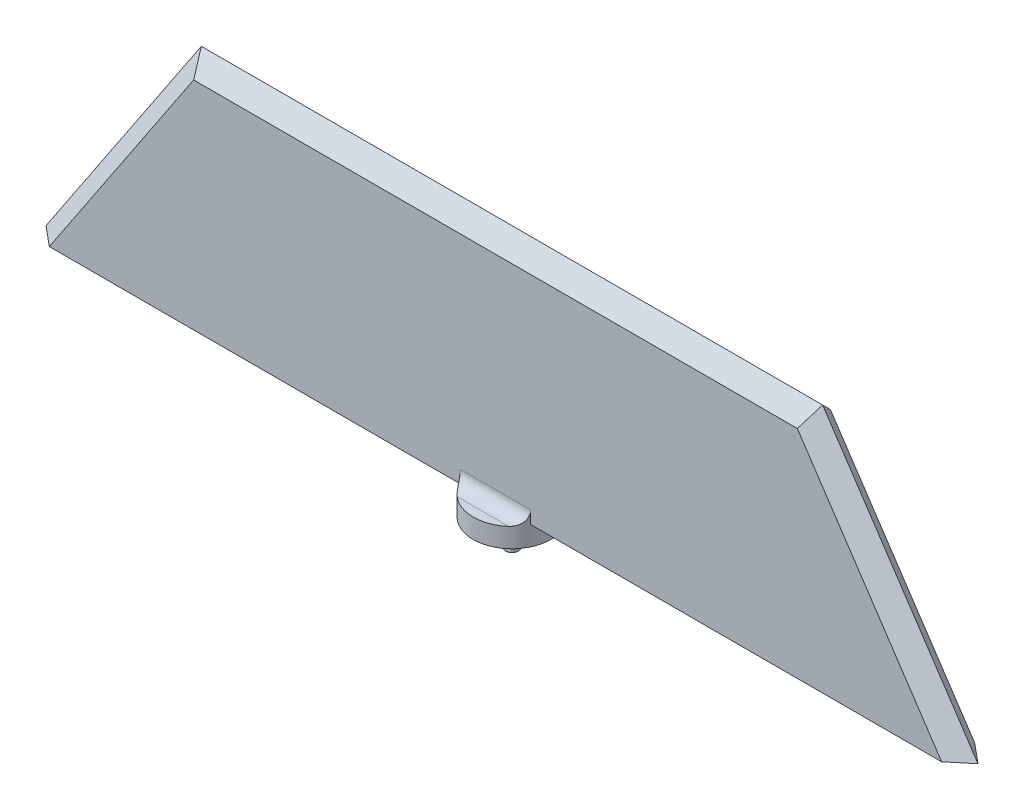
ISO-10303-21;
HEADER;
FILE_DESCRIPTION(('STEP AP214'),'2;1');
FILE_NAME('part.step','',(''),(''),'','','');
FILE_SCHEMA(('AUTOMOTIVE_DESIGN { 1 0 10303 214 1 1 1 1 }'));
ENDSEC;
DATA;
#1=APPLICATION_CONTEXT('core data for automotive mechanical design processes');
#2=APPLICATION_PROTOCOL_DEFINITION('international standard','automotive_design',2000,#1);
#3=PRODUCT_CONTEXT('',#1,'mechanical');
#4=PRODUCT('Part','Part','',(#3));
#5=PRODUCT_RELATED_PRODUCT_CATEGORY('part','',(#4));
#6=PRODUCT_DEFINITION_FORMATION('','',#4);
#7=PRODUCT_DEFINITION_CONTEXT('part definition',#1,'design');
#8=PRODUCT_DEFINITION('design','',#6,#7);
#9=PRODUCT_DEFINITION_SHAPE('','',#8);
#10=(LENGTH_UNIT() NAMED_UNIT(*) SI_UNIT(.MILLI.,.METRE.));
#11=(NAMED_UNIT(*) PLANE_ANGLE_UNIT() SI_UNIT($,.RADIAN.));
#12=(NAMED_UNIT(*) SI_UNIT($,.STERADIAN.) SOLID_ANGLE_UNIT());
#13=UNCERTAINTY_MEASURE_WITH_UNIT(LENGTH_MEASURE(1.E-05),#10,'distance_accuracy_value','');
#14=(GEOMETRIC_REPRESENTATION_CONTEXT(3) GLOBAL_UNCERTAINTY_ASSIGNED_CONTEXT((#13)) GLOBAL_UNIT_ASSIGNED_CONTEXT((#10,
#11,#12)) REPRESENTATION_CONTEXT('',''));
#15=CARTESIAN_POINT('',(0.,0.,0.));
#16=DIRECTION('',(0.,0.,1.));
#17=DIRECTION('',(1.,0.,0.));
#18=AXIS2_PLACEMENT_3D('',#15,#16,#17);
#19=CARTESIAN_POINT('',(60.,0.,2.125));
#20=DIRECTION('',(0.,1.,0.));
#21=DIRECTION('',(0.,0.,1.));
#22=AXIS2_PLACEMENT_3D('',#19,#20,#21);
#23=PLANE('',#22);
#24=DIRECTION('',(1.,0.,0.));
#25=VECTOR('',#24,1.);
#26=CARTESIAN_POINT('',(60.,0.,-2.125));
#27=LINE('',#26,#25);
#28=CARTESIAN_POINT('',(4.52596674755792,0.,-2.125));
#29=VERTEX_POINT('',#28);
#30=CARTESIAN_POINT('',(57.4460678465463,0.,-2.125));
#31=VERTEX_POINT('',#30);
#32=EDGE_CURVE('E224',#29,#31,#27,.T.);
#33=ORIENTED_EDGE('',*,*,#32,.T.);
#34=DIRECTION('',(0.768706114785809,0.,0.63960214906683));
#35=VECTOR('',#34,1.);
#36=CARTESIAN_POINT('',(48.1818181818181,0.,-9.83332166035634));
#37=LINE('',#36,#35);
#38=CARTESIAN_POINT('',(60.,0.,0.));
#39=VERTEX_POINT('',#38);
#40=EDGE_CURVE('E155',#31,#39,#37,.T.);
#41=ORIENTED_EDGE('',*,*,#40,.T.);
#42=DIRECTION('',(0.768706114785806,0.,-0.639602149066832));
#43=VECTOR('',#42,1.);
#44=CARTESIAN_POINT('',(47.0013282380834,0.,10.8155486655038));
#45=LINE('',#44,#43);
#46=CARTESIAN_POINT('',(57.4460678465463,0.,2.125));
#47=VERTEX_POINT('',#46);
#48=EDGE_CURVE('E194',#39,#47,#45,.F.);
#49=ORIENTED_EDGE('',*,*,#48,.T.);
#50=DIRECTION('',(1.,0.,0.));
#51=VECTOR('',#50,1.);
#52=CARTESIAN_POINT('',(60.,0.,2.125));
#53=LINE('',#52,#51);
#54=CARTESIAN_POINT('',(4.52596674755792,0.,2.125));
#55=VERTEX_POINT('',#54);
#56=EDGE_CURVE('E233',#55,#47,#53,.T.);
#57=ORIENTED_EDGE('',*,*,#56,.F.);
#58=CARTESIAN_POINT('',(0.,0.,0.));
#59=DIRECTION('',(0.,-1.,0.));
#60=DIRECTION('',(0.,0.,-1.));
#61=AXIS2_PLACEMENT_3D('',#58,#59,#60);
#62=CIRCLE('',#61,5.);
#63=EDGE_CURVE('E225',#29,#55,#62,.T.);
#64=ORIENTED_EDGE('',*,*,#63,.F.);
#65=EDGE_LOOP('',(#33,#41,#49,#57,#64));
#66=FACE_BOUND('',#65,.T.);
#67=ADVANCED_FACE('F47',(#66),#23,.F.);
#68=DIRECTION('',(0.768706114785807,0.,0.639602149066832));
#69=VECTOR('',#68,1.);
#70=CARTESIAN_POINT('',(-47.0013282380834,0.,10.8155486655038));
#71=LINE('',#70,#69);
#72=CARTESIAN_POINT('',(-57.4460678465463,0.,2.125));
#73=VERTEX_POINT('',#72);
#74=CARTESIAN_POINT('',(-60.,0.,0.));
#75=VERTEX_POINT('',#74);
#76=EDGE_CURVE('E149',#73,#75,#71,.F.);
#77=ORIENTED_EDGE('',*,*,#76,.T.);
#78=DIRECTION('',(0.768706114785809,0.,-0.639602149066829));
#79=VECTOR('',#78,1.);
#80=CARTESIAN_POINT('',(-60.,0.,0.));
#81=LINE('',#80,#79);
#82=CARTESIAN_POINT('',(-57.4460678465463,0.,-2.125));
#83=VERTEX_POINT('',#82);
#84=EDGE_CURVE('E152',#75,#83,#81,.T.);
#85=ORIENTED_EDGE('',*,*,#84,.T.);
#86=CARTESIAN_POINT('',(-4.52596674755792,0.,-2.125));
#87=VERTEX_POINT('',#86);
#88=EDGE_CURVE('E92',#83,#87,#27,.T.);
#89=ORIENTED_EDGE('',*,*,#88,.T.);
#90=CARTESIAN_POINT('',(-4.52596674755792,0.,2.125));
#91=VERTEX_POINT('',#90);
#92=EDGE_CURVE('E230',#91,#87,#62,.T.);
#93=ORIENTED_EDGE('',*,*,#92,.F.);
#94=EDGE_CURVE('E153',#73,#91,#53,.T.);
#95=ORIENTED_EDGE('',*,*,#94,.F.);
#96=EDGE_LOOP('',(#77,#85,#89,#93,#95));
#97=FACE_BOUND('',#96,.T.);
#98=ADVANCED_FACE('F150',(#97),#23,.F.);
#99=CARTESIAN_POINT('',(0.,0.,2.125));
#100=DIRECTION('',(0.,0.,-1.));
#101=DIRECTION('',(-1.,0.,0.));
#102=AXIS2_PLACEMENT_3D('',#99,#100,#101);
#103=PLANE('',#102);
#104=ORIENTED_EDGE('',*,*,#56,.T.);
#105=DIRECTION('',(-0.554700196225229,0.832050294337843,0.));
#106=VECTOR('',#105,1.);
#107=CARTESIAN_POINT('',(39.7703546629936,26.5135697753291,2.125));
#108=LINE('',#107,#106);
#109=CARTESIAN_POINT('',(38.862734513213,27.875,2.125));
#110=VERTEX_POINT('',#109);
#111=EDGE_CURVE('E11',#47,#110,#108,.T.);
#112=ORIENTED_EDGE('',*,*,#111,.T.);
#113=DIRECTION('',(-1.,0.,0.));
#114=VECTOR('',#113,1.);
#115=CARTESIAN_POINT('',(0.,27.875,2.125));
#116=LINE('',#115,#114);
#117=CARTESIAN_POINT('',(-38.862734513213,27.875,2.125));
#118=VERTEX_POINT('',#117);
#119=EDGE_CURVE('E59',#110,#118,#116,.T.);
#120=ORIENTED_EDGE('',*,*,#119,.T.);
#121=DIRECTION('',(-0.554700196225229,-0.832050294337844,0.));
#122=VECTOR('',#121,1.);
#123=CARTESIAN_POINT('',(-39.7703546629936,26.5135697753291,2.125));
#124=LINE('',#123,#122);
#125=EDGE_CURVE('E165',#118,#73,#124,.T.);
#126=ORIENTED_EDGE('',*,*,#125,.T.);
#127=ORIENTED_EDGE('',*,*,#94,.T.);
#128=DIRECTION('',(0.,1.,0.));
#129=VECTOR('',#128,1.);
#130=CARTESIAN_POINT('',(-4.52596674755792,0.,2.125));
#131=LINE('',#130,#129);
#132=CARTESIAN_POINT('',(-4.52596674755792,1.625,2.125));
#133=VERTEX_POINT('',#132);
#134=EDGE_CURVE('E251',#91,#133,#131,.T.);
#135=ORIENTED_EDGE('',*,*,#134,.T.);
#136=DIRECTION('',(1.,0.,0.));
#137=VECTOR('',#136,1.);
#138=CARTESIAN_POINT('',(4.52596674755792,1.625,2.125));
#139=LINE('',#138,#137);
#140=CARTESIAN_POINT('',(4.52596674755792,1.625,2.125));
#141=VERTEX_POINT('',#140);
#142=EDGE_CURVE('E255',#133,#141,#139,.T.);
#143=ORIENTED_EDGE('',*,*,#142,.T.);
#144=DIRECTION('',(0.,1.,0.));
#145=VECTOR('',#144,1.);
#146=CARTESIAN_POINT('',(4.52596674755792,1.625,2.125));
#147=LINE('',#146,#145);
#148=EDGE_CURVE('E259',#141,#55,#147,.F.);
#149=ORIENTED_EDGE('',*,*,#148,.T.);
#150=EDGE_LOOP('',(#104,#112,#120,#126,#127,#135,#143,#149));
#151=FACE_BOUND('',#150,.T.);
#152=ADVANCED_FACE('F347',(#151),#103,.F.);
#153=CARTESIAN_POINT('',(0.,0.,-2.125));
#154=DIRECTION('',(0.,0.,-1.));
#155=DIRECTION('',(-1.,0.,0.));
#156=AXIS2_PLACEMENT_3D('',#153,#154,#155);
#157=PLANE('',#156);
#158=DIRECTION('',(1.,0.,0.));
#159=VECTOR('',#158,1.);
#160=CARTESIAN_POINT('',(40.,27.875,-2.125));
#161=LINE('',#160,#159);
#162=CARTESIAN_POINT('',(-38.862734513213,27.875,-2.125));
#163=VERTEX_POINT('',#162);
#164=CARTESIAN_POINT('',(38.862734513213,27.875,-2.125));
#165=VERTEX_POINT('',#164);
#166=EDGE_CURVE('E204',#163,#165,#161,.T.);
#167=ORIENTED_EDGE('',*,*,#166,.T.);
#168=DIRECTION('',(0.554700196225229,-0.832050294337843,0.));
#169=VECTOR('',#168,1.);
#170=CARTESIAN_POINT('',(58.2318931245321,-1.17873791697861,-2.125));
#171=LINE('',#170,#169);
#172=EDGE_CURVE('E200',#165,#31,#171,.T.);
#173=ORIENTED_EDGE('',*,*,#172,.T.);
#174=ORIENTED_EDGE('',*,*,#32,.F.);
#175=DIRECTION('',(0.,1.,0.));
#176=VECTOR('',#175,1.);
#177=CARTESIAN_POINT('',(4.52596674755792,0.,-2.125));
#178=LINE('',#177,#176);
#179=CARTESIAN_POINT('',(4.52596674755792,1.625,-2.125));
#180=VERTEX_POINT('',#179);
#181=EDGE_CURVE('E247',#29,#180,#178,.T.);
#182=ORIENTED_EDGE('',*,*,#181,.T.);
#183=DIRECTION('',(1.,0.,0.));
#184=VECTOR('',#183,1.);
#185=CARTESIAN_POINT('',(0.,1.625,-2.125));
#186=LINE('',#185,#184);
#187=CARTESIAN_POINT('',(-4.52596674755792,1.625,-2.125));
#188=VERTEX_POINT('',#187);
#189=EDGE_CURVE('E243',#180,#188,#186,.F.);
#190=ORIENTED_EDGE('',*,*,#189,.T.);
#191=DIRECTION('',(0.,1.,0.));
#192=VECTOR('',#191,1.);
#193=CARTESIAN_POINT('',(-4.52596674755792,1.625,-2.125));
#194=LINE('',#193,#192);
#195=EDGE_CURVE('E240',#188,#87,#194,.F.);
#196=ORIENTED_EDGE('',*,*,#195,.T.);
#197=ORIENTED_EDGE('',*,*,#88,.F.);
#198=DIRECTION('',(0.554700196225229,0.832050294337844,0.));
#199=VECTOR('',#198,1.);
#200=CARTESIAN_POINT('',(-38.2318931245321,28.8212620830214,-2.125));
#201=LINE('',#200,#199);
#202=EDGE_CURVE('E163',#83,#163,#201,.T.);
#203=ORIENTED_EDGE('',*,*,#202,.T.);
#204=EDGE_LOOP('',(#167,#173,#174,#182,#190,#196,#197,#203));
#205=FACE_BOUND('',#204,.T.);
#206=ADVANCED_FACE('F329',(#205),#157,.T.);
#207=CARTESIAN_POINT('',(0.,0.,0.));
#208=DIRECTION('',(0.,-1.,0.));
#209=DIRECTION('',(0.,0.,-1.));
#210=AXIS2_PLACEMENT_3D('',#207,#208,#209);
#211=PLANE('',#210);
#212=CARTESIAN_POINT('',(-3.30718913883074,0.,-3.75));
#213=VERTEX_POINT('',#212);
#214=CARTESIAN_POINT('',(3.30718913883074,0.,-3.75));
#215=VERTEX_POINT('',#214);
#216=EDGE_CURVE('E216',#213,#215,#62,.T.);
#217=ORIENTED_EDGE('',*,*,#216,.F.);
#218=DIRECTION('',(1.,0.,0.));
#219=VECTOR('',#218,1.);
#220=CARTESIAN_POINT('',(0.,0.,-3.75));
#221=LINE('',#220,#219);
#222=EDGE_CURVE('E236',#213,#215,#221,.T.);
#223=ORIENTED_EDGE('',*,*,#222,.T.);
#224=EDGE_LOOP('',(#217,#223));
#225=FACE_BOUND('',#224,.T.);
#226=ADVANCED_FACE('F353',(#225),#211,.F.);
#227=CARTESIAN_POINT('',(0.,-2.5,0.));
#228=DIRECTION('',(0.,1.,0.));
#229=DIRECTION('',(0.,0.,1.));
#230=AXIS2_PLACEMENT_3D('',#227,#228,#229);
#231=CYLINDRICAL_SURFACE('',#230,5.);
#232=CARTESIAN_POINT('',(0.,-2.5,0.));
#233=DIRECTION('',(0.,-1.,0.));
#234=DIRECTION('',(0.,0.,-1.));
#235=AXIS2_PLACEMENT_3D('',#232,#233,#234);
#236=CIRCLE('',#235,5.);
#237=CARTESIAN_POINT('',(0.,-2.5,-5.));
#238=VERTEX_POINT('',#237);
#239=EDGE_CURVE('E220',#238,#238,#236,.T.);
#240=ORIENTED_EDGE('',*,*,#239,.F.);
#241=EDGE_LOOP('',(#240));
#242=FACE_BOUND('',#241,.T.);
#243=ORIENTED_EDGE('',*,*,#63,.T.);
#244=ORIENTED_EDGE('',*,*,#148,.F.);
#245=CARTESIAN_POINT('',(4.52596674755792,1.625,2.125));
#246=CARTESIAN_POINT('',(4.5259640118528,1.58318476431478,2.12499854200673));
#247=CARTESIAN_POINT('',(4.52520873807404,1.54138990550684,2.12661525678972));
#248=CARTESIAN_POINT('',(4.52217897896237,1.4581074066157,2.13305321646631));
#249=CARTESIAN_POINT('',(4.5199046468321,1.416619735978,2.13787413820355));
#250=CARTESIAN_POINT('',(4.51079889746698,1.29323830697777,2.15705962855797));
#251=CARTESIAN_POINT('',(4.5016848483147,1.21218585971538,2.17614732435104));
#252=CARTESIAN_POINT('',(4.47720241072087,1.05481409274936,2.22607752043022));
#253=CARTESIAN_POINT('',(4.46183240183261,0.978496005267672,2.25692306615575));
#254=CARTESIAN_POINT('',(4.42465488931795,0.832603273968117,2.32896219433437));
#255=CARTESIAN_POINT('',(4.40284657081052,0.763029485241139,2.3701570865804));
#256=CARTESIAN_POINT('',(4.35235859684598,0.631368026579916,2.46165237885462));
#257=CARTESIAN_POINT('',(4.32358629363317,0.569399890327431,2.51207310052849));
#258=CARTESIAN_POINT('',(4.25947729707789,0.455264127720277,2.61930287576033));
#259=CARTESIAN_POINT('',(4.22414339238915,0.403092356823848,2.67610921142569));
#260=CARTESIAN_POINT('',(4.14471347229897,0.305854113258727,2.79766967192731));
#261=CARTESIAN_POINT('',(4.10019280809349,0.261484752554977,2.86270093117706));
#262=CARTESIAN_POINT('',(4.00461769960499,0.184022093944827,2.99494763149877));
#263=CARTESIAN_POINT('',(3.95354364485399,0.150963778909927,3.06216915693096));
#264=CARTESIAN_POINT('',(3.85629628658796,0.1008688378976,3.18336307438311));
#265=CARTESIAN_POINT('',(3.81110048607908,0.0819669034360022,3.23737066108111));
#266=CARTESIAN_POINT('',(3.71745257228705,0.0504186182652357,3.34448993095674));
#267=CARTESIAN_POINT('',(3.66899649582744,0.0377800432042083,3.39760042186128));
#268=CARTESIAN_POINT('',(3.56960001039051,0.0181838283949912,3.50187208429115));
#269=CARTESIAN_POINT('',(3.51867627961159,0.0111925079215906,3.55304305163925));
#270=CARTESIAN_POINT('',(3.41456677060383,0.0021093091982726,3.65321399781097));
#271=CARTESIAN_POINT('',(3.36138727820916,4.62373305204701E-06,3.70221932067071));
#272=CARTESIAN_POINT('',(3.30718913883074,0.,3.75));
#273=B_SPLINE_CURVE_WITH_KNOTS('',3,(#245,#246,#247,#248,#249,#250,#251,#252,#253,#254,#255,
#256,#257,#258,#259,#260,#261,#262,#263,#264,#265,#266,#267,#268,#269,#270,#271,#272),
.UNSPECIFIED.,.F.,.F.,(4,2,2,2,2,2,2,2,2,2,2,2,2,4),(0.,0.125367311966217,0.250721982084772,
0.500719852876186,0.750782520486905,1.00087685149373,1.25450141495388,1.50801843467965,
1.77828391775905,2.04937787976594,2.26777025016329,2.48643306882065,2.70378192916987,
2.9205605011169),.UNSPECIFIED.);
#274=CARTESIAN_POINT('',(3.30718913883074,0.,3.75));
#275=VERTEX_POINT('',#274);
#276=EDGE_CURVE('E302',#141,#275,#273,.T.);
#277=ORIENTED_EDGE('',*,*,#276,.T.);
#278=CARTESIAN_POINT('',(-3.30718913883074,0.,3.75));
#279=VERTEX_POINT('',#278);
#280=EDGE_CURVE('E229',#275,#279,#62,.T.);
#281=ORIENTED_EDGE('',*,*,#280,.T.);
#282=CARTESIAN_POINT('',(-3.30718913883074,0.,3.75));
#283=CARTESIAN_POINT('',(-3.35855854077015,4.19469649101541E-06,3.70471004620286));
#284=CARTESIAN_POINT('',(-3.4090107746535,0.00189497919016327,3.65832591898638));
#285=CARTESIAN_POINT('',(-3.50789071579649,0.0100215079651662,3.5636179801978));
#286=CARTESIAN_POINT('',(-3.55631397410516,0.0162663197340261,3.51529031939689));
#287=CARTESIAN_POINT('',(-3.65109628823175,0.0337451840319122,3.41675394059248));
#288=CARTESIAN_POINT('',(-3.69743633530978,0.0450177065688156,3.36653350584485));
#289=CARTESIAN_POINT('',(-3.78724517710932,0.0731189645387651,3.26517386489831));
#290=CARTESIAN_POINT('',(-3.83071651250189,0.0899427020920039,3.21403552412936));
#291=CARTESIAN_POINT('',(-3.93402570458431,0.138981026721796,3.08752826428691));
#292=CARTESIAN_POINT('',(-3.99204580318636,0.17471431978063,3.01197725552179));
#293=CARTESIAN_POINT('',(-4.09986127072873,0.260437086850959,2.86348357195838));
#294=CARTESIAN_POINT('',(-4.1496827974588,0.310379776516645,2.79053320722297));
#295=CARTESIAN_POINT('',(-4.24076242384928,0.425363665016969,2.65009447093618));
#296=CARTESIAN_POINT('',(-4.28194614185894,0.490526547919216,2.58265636923887));
#297=CARTESIAN_POINT('',(-4.35467438910986,0.634760154022489,2.45805645933646));
#298=CARTESIAN_POINT('',(-4.38621594408429,0.713835156794483,2.40089782421775));
#299=CARTESIAN_POINT('',(-4.43642557035173,0.873378328335294,2.30665324926387));
#300=CARTESIAN_POINT('',(-4.45617264872158,0.952584306127615,2.26799567493499));
#301=CARTESIAN_POINT('',(-4.48829045185621,1.11749049002416,2.20375787570983));
#302=CARTESIAN_POINT('',(-4.50066930840598,1.20318341872236,2.17816323863947));
#303=CARTESIAN_POINT('',(-4.51499967892129,1.34546605649945,2.14824094768866));
#304=CARTESIAN_POINT('',(-4.51911914447193,1.4009650144687,2.13954018943143));
#305=CARTESIAN_POINT('',(-4.52459744396582,1.51263260006678,2.12791693816898));
#306=CARTESIAN_POINT('',(-4.52595953038208,1.5688003600155,2.12498763753664));
#307=CARTESIAN_POINT('',(-4.52596674755792,1.625,2.125));
#308=B_SPLINE_CURVE_WITH_KNOTS('',3,(#282,#283,#284,#285,#286,#287,#288,#289,#290,#291,#292,
#293,#294,#295,#296,#297,#298,#299,#300,#301,#302,#303,#304,#305,#306,#307),.UNSPECIFIED.,.F.,
.F.,(4,2,2,2,2,2,2,2,2,2,2,2,4),(0.,0.205462857556789,0.411354885228317,0.618850087176116,
0.82615898409127,1.13011240812764,1.43307642429403,1.73855094414234,2.04411959723308,
2.31368059244002,2.58294353798646,2.75158706681591,2.92003155559578),.UNSPECIFIED.);
#309=EDGE_CURVE('E308',#279,#133,#308,.T.);
#310=ORIENTED_EDGE('',*,*,#309,.T.);
#311=ORIENTED_EDGE('',*,*,#134,.F.);
#312=ORIENTED_EDGE('',*,*,#92,.T.);
#313=ORIENTED_EDGE('',*,*,#195,.F.);
#314=CARTESIAN_POINT('',(-4.52596674755792,1.625,-2.125));
#315=CARTESIAN_POINT('',(-4.5259640118528,1.58318476431478,-2.12499854200673));
#316=CARTESIAN_POINT('',(-4.52520873807404,1.54138990550684,-2.12661525678972));
#317=CARTESIAN_POINT('',(-4.52217897896237,1.4581074066157,-2.13305321646631));
#318=CARTESIAN_POINT('',(-4.5199046468321,1.416619735978,-2.13787413820355));
#319=CARTESIAN_POINT('',(-4.51079889746698,1.29323830697777,-2.15705962855797));
#320=CARTESIAN_POINT('',(-4.5016848483147,1.21218585971538,-2.17614732435104));
#321=CARTESIAN_POINT('',(-4.47720241072087,1.05481409274936,-2.22607752043022));
#322=CARTESIAN_POINT('',(-4.46183240183261,0.978496005267672,-2.25692306615575));
#323=CARTESIAN_POINT('',(-4.42465488931795,0.832603273968117,-2.32896219433437));
#324=CARTESIAN_POINT('',(-4.40284657081052,0.763029485241139,-2.3701570865804));
#325=CARTESIAN_POINT('',(-4.35235859684598,0.631368026579916,-2.46165237885462));
#326=CARTESIAN_POINT('',(-4.32358629363317,0.569399890327431,-2.51207310052849));
#327=CARTESIAN_POINT('',(-4.25947729707789,0.455264127720277,-2.61930287576033));
#328=CARTESIAN_POINT('',(-4.22414339238915,0.403092356823848,-2.67610921142569));
#329=CARTESIAN_POINT('',(-4.14471347229897,0.305854113258727,-2.79766967192731));
#330=CARTESIAN_POINT('',(-4.10019280809349,0.261484752554977,-2.86270093117706));
#331=CARTESIAN_POINT('',(-4.00461769960499,0.184022093944827,-2.99494763149877));
#332=CARTESIAN_POINT('',(-3.95354364485399,0.150963778909927,-3.06216915693096));
#333=CARTESIAN_POINT('',(-3.85629628658796,0.1008688378976,-3.18336307438311));
#334=CARTESIAN_POINT('',(-3.81110048607908,0.0819669034360022,-3.23737066108111));
#335=CARTESIAN_POINT('',(-3.71745257228705,0.0504186182652357,-3.34448993095674));
#336=CARTESIAN_POINT('',(-3.66899649582744,0.0377800432042083,-3.39760042186128));
#337=CARTESIAN_POINT('',(-3.56960001039051,0.0181838283949912,-3.50187208429115));
#338=CARTESIAN_POINT('',(-3.51867627961159,0.0111925079215906,-3.55304305163925));
#339=CARTESIAN_POINT('',(-3.41456677060383,0.0021093091982726,-3.65321399781097));
#340=CARTESIAN_POINT('',(-3.36138727820916,4.62373305204701E-06,-3.70221932067071));
#341=CARTESIAN_POINT('',(-3.30718913883074,0.,-3.75));
#342=B_SPLINE_CURVE_WITH_KNOTS('',3,(#314,#315,#316,#317,#318,#319,#320,#321,#322,#323,#324,
#325,#326,#327,#328,#329,#330,#331,#332,#333,#334,#335,#336,#337,#338,#339,#340,#341),
.UNSPECIFIED.,.F.,.F.,(4,2,2,2,2,2,2,2,2,2,2,2,2,4),(0.,0.125367311966217,0.250721982084772,
0.500719852876186,0.750782520486905,1.00087685149373,1.25450141495388,1.50801843467965,
1.77828391775905,2.04937787976594,2.26777025016329,2.48643306882065,2.70378192916987,
2.9205605011169),.UNSPECIFIED.);
#343=EDGE_CURVE('E274',#188,#213,#342,.T.);
#344=ORIENTED_EDGE('',*,*,#343,.T.);
#345=ORIENTED_EDGE('',*,*,#216,.T.);
#346=CARTESIAN_POINT('',(3.30718913883074,0.,-3.75));
#347=CARTESIAN_POINT('',(3.35855854077015,4.19469649101541E-06,-3.70471004620286));
#348=CARTESIAN_POINT('',(3.4090107746535,0.00189497919016327,-3.65832591898638));
#349=CARTESIAN_POINT('',(3.50789071579649,0.0100215079651662,-3.5636179801978));
#350=CARTESIAN_POINT('',(3.55631397410516,0.0162663197340261,-3.51529031939689));
#351=CARTESIAN_POINT('',(3.65109628823175,0.0337451840319122,-3.41675394059248));
#352=CARTESIAN_POINT('',(3.69743633530978,0.0450177065688156,-3.36653350584485));
#353=CARTESIAN_POINT('',(3.78724517710932,0.0731189645387651,-3.26517386489831));
#354=CARTESIAN_POINT('',(3.83071651250189,0.0899427020920039,-3.21403552412936));
#355=CARTESIAN_POINT('',(3.93402570458431,0.138981026721796,-3.08752826428691));
#356=CARTESIAN_POINT('',(3.99204580318636,0.17471431978063,-3.01197725552179));
#357=CARTESIAN_POINT('',(4.09986127072873,0.260437086850959,-2.86348357195838));
#358=CARTESIAN_POINT('',(4.1496827974588,0.310379776516645,-2.79053320722297));
#359=CARTESIAN_POINT('',(4.24076242384928,0.425363665016969,-2.65009447093618));
#360=CARTESIAN_POINT('',(4.28194614185894,0.490526547919216,-2.58265636923887));
#361=CARTESIAN_POINT('',(4.35467438910986,0.634760154022489,-2.45805645933646));
#362=CARTESIAN_POINT('',(4.38621594408429,0.713835156794483,-2.40089782421775));
#363=CARTESIAN_POINT('',(4.43642557035173,0.873378328335294,-2.30665324926387));
#364=CARTESIAN_POINT('',(4.45617264872158,0.952584306127615,-2.26799567493499));
#365=CARTESIAN_POINT('',(4.48829045185621,1.11749049002416,-2.20375787570983));
#366=CARTESIAN_POINT('',(4.50066930840598,1.20318341872236,-2.17816323863947));
#367=CARTESIAN_POINT('',(4.51499967892129,1.34546605649945,-2.14824094768866));
#368=CARTESIAN_POINT('',(4.51911914447193,1.4009650144687,-2.13954018943143));
#369=CARTESIAN_POINT('',(4.52459744396582,1.51263260006678,-2.12791693816898));
#370=CARTESIAN_POINT('',(4.52595953038208,1.5688003600155,-2.12498763753664));
#371=CARTESIAN_POINT('',(4.52596674755792,1.625,-2.125));
#372=B_SPLINE_CURVE_WITH_KNOTS('',3,(#346,#347,#348,#349,#350,#351,#352,#353,#354,#355,#356,
#357,#358,#359,#360,#361,#362,#363,#364,#365,#366,#367,#368,#369,#370,#371),.UNSPECIFIED.,.F.,
.F.,(4,2,2,2,2,2,2,2,2,2,2,2,4),(0.,0.205462857556789,0.411354885228317,0.618850087176116,
0.82615898409127,1.13011240812764,1.43307642429403,1.73855094414234,2.04411959723308,
2.31368059244002,2.58294353798646,2.75158706681591,2.92003155559578),.UNSPECIFIED.);
#373=EDGE_CURVE('E265',#215,#180,#372,.T.);
#374=ORIENTED_EDGE('',*,*,#373,.T.);
#375=ORIENTED_EDGE('',*,*,#181,.F.);
#376=EDGE_LOOP('',(#243,#244,#277,#281,#310,#311,#312,#313,#344,#345,#374,#375));
#377=FACE_BOUND('',#376,.T.);
#378=ADVANCED_FACE('F280',(#242,#377),#231,.T.);
#379=CARTESIAN_POINT('',(0.,-2.5,0.));
#380=DIRECTION('',(0.,-1.,0.));
#381=DIRECTION('',(0.,0.,-1.));
#382=AXIS2_PLACEMENT_3D('',#379,#380,#381);
#383=PLANE('',#382);
#384=CARTESIAN_POINT('',(0.,-2.5,0.));
#385=DIRECTION('',(0.,-1.,0.));
#386=DIRECTION('',(0.,0.,-1.));
#387=AXIS2_PLACEMENT_3D('',#384,#385,#386);
#388=CIRCLE('',#387,2.45);
#389=CARTESIAN_POINT('',(0.,-2.5,-2.45));
#390=VERTEX_POINT('',#389);
#391=EDGE_CURVE('E207',#390,#390,#388,.T.);
#392=ORIENTED_EDGE('',*,*,#391,.F.);
#393=EDGE_LOOP('',(#392));
#394=FACE_BOUND('',#393,.T.);
#395=ORIENTED_EDGE('',*,*,#239,.T.);
#396=EDGE_LOOP('',(#395));
#397=FACE_BOUND('',#396,.T.);
#398=ADVANCED_FACE('F358',(#394,#397),#383,.T.);
#399=ORIENTED_EDGE('',*,*,#280,.F.);
#400=DIRECTION('',(1.,0.,0.));
#401=VECTOR('',#400,1.);
#402=CARTESIAN_POINT('',(-4.52596674755792,0.,3.75));
#403=LINE('',#402,#401);
#404=EDGE_CURVE('E262',#275,#279,#403,.F.);
#405=ORIENTED_EDGE('',*,*,#404,.T.);
#406=EDGE_LOOP('',(#399,#405));
#407=FACE_BOUND('',#406,.T.);
#408=ADVANCED_FACE('F290',(#407),#211,.F.);
#409=CARTESIAN_POINT('',(0.,1.625,-3.75));
#410=DIRECTION('',(1.,0.,0.));
#411=DIRECTION('',(0.,0.,-1.));
#412=AXIS2_PLACEMENT_3D('',#409,#410,#411);
#413=CYLINDRICAL_SURFACE('',#412,1.625);
#414=ORIENTED_EDGE('',*,*,#343,.F.);
#415=ORIENTED_EDGE('',*,*,#189,.F.);
#416=ORIENTED_EDGE('',*,*,#373,.F.);
#417=ORIENTED_EDGE('',*,*,#222,.F.);
#418=EDGE_LOOP('',(#414,#415,#416,#417));
#419=FACE_BOUND('',#418,.T.);
#420=ADVANCED_FACE('F284',(#419),#413,.F.);
#421=CARTESIAN_POINT('',(0.,1.625,3.75));
#422=DIRECTION('',(-1.,0.,0.));
#423=DIRECTION('',(0.,0.,1.));
#424=AXIS2_PLACEMENT_3D('',#421,#422,#423);
#425=CYLINDRICAL_SURFACE('',#424,1.625);
#426=ORIENTED_EDGE('',*,*,#309,.F.);
#427=ORIENTED_EDGE('',*,*,#404,.F.);
#428=ORIENTED_EDGE('',*,*,#276,.F.);
#429=ORIENTED_EDGE('',*,*,#142,.F.);
#430=EDGE_LOOP('',(#426,#427,#428,#429));
#431=FACE_BOUND('',#430,.T.);
#432=ADVANCED_FACE('F289',(#431),#425,.F.);
#433=CARTESIAN_POINT('',(0.,0.6,0.));
#434=DIRECTION('',(0.,-1.,0.));
#435=DIRECTION('',(0.,0.,-1.));
#436=AXIS2_PLACEMENT_3D('',#433,#434,#435);
#437=CYLINDRICAL_SURFACE('',#436,2.45);
#438=CARTESIAN_POINT('',(0.,0.6,0.));
#439=DIRECTION('',(0.,-1.,0.));
#440=DIRECTION('',(0.,0.,-1.));
#441=AXIS2_PLACEMENT_3D('',#438,#439,#440);
#442=CIRCLE('',#441,2.45);
#443=CARTESIAN_POINT('',(0.,0.6,-2.45));
#444=VERTEX_POINT('',#443);
#445=EDGE_CURVE('E210',#444,#444,#442,.T.);
#446=CARTESIAN_POINT('',(0.,0.6,-2.45));
#447=CARTESIAN_POINT('',(0.,0.567708333333333,-2.45));
#448=CARTESIAN_POINT('',(0.,0.535416666666667,-2.45));
#449=CARTESIAN_POINT('',(0.,0.470833333333333,-2.45));
#450=CARTESIAN_POINT('',(0.,0.438541666666667,-2.45));
#451=CARTESIAN_POINT('',(0.,0.373958333333333,-2.45));
#452=CARTESIAN_POINT('',(0.,0.341666666666667,-2.45));
#453=CARTESIAN_POINT('',(0.,0.277083333333333,-2.45));
#454=CARTESIAN_POINT('',(0.,0.244791666666667,-2.45));
#455=CARTESIAN_POINT('',(0.,0.180208333333333,-2.45));
#456=CARTESIAN_POINT('',(0.,0.147916666666667,-2.45));
#457=CARTESIAN_POINT('',(0.,0.0833333333333332,-2.45));
#458=CARTESIAN_POINT('',(0.,0.0510416666666666,-2.45));
#459=CARTESIAN_POINT('',(0.,-0.0135416666666668,-2.45));
#460=CARTESIAN_POINT('',(0.,-0.0458333333333335,-2.45));
#461=CARTESIAN_POINT('',(0.,-0.110416666666667,-2.45));
#462=CARTESIAN_POINT('',(0.,-0.142708333333333,-2.45));
#463=CARTESIAN_POINT('',(0.,-0.207291666666667,-2.45));
#464=CARTESIAN_POINT('',(0.,-0.239583333333333,-2.45));
#465=CARTESIAN_POINT('',(0.,-0.304166666666667,-2.45));
#466=CARTESIAN_POINT('',(0.,-0.336458333333333,-2.45));
#467=CARTESIAN_POINT('',(0.,-0.401041666666667,-2.45));
#468=CARTESIAN_POINT('',(0.,-0.433333333333333,-2.45));
#469=CARTESIAN_POINT('',(0.,-0.497916666666667,-2.45));
#470=CARTESIAN_POINT('',(0.,-0.530208333333333,-2.45));
#471=CARTESIAN_POINT('',(0.,-0.594791666666667,-2.45));
#472=CARTESIAN_POINT('',(0.,-0.627083333333333,-2.45));
#473=CARTESIAN_POINT('',(0.,-0.691666666666667,-2.45));
#474=CARTESIAN_POINT('',(0.,-0.723958333333333,-2.45));
#475=CARTESIAN_POINT('',(0.,-0.788541666666667,-2.45));
#476=CARTESIAN_POINT('',(0.,-0.820833333333333,-2.45));
#477=CARTESIAN_POINT('',(0.,-0.885416666666667,-2.45));
#478=CARTESIAN_POINT('',(0.,-0.917708333333333,-2.45));
#479=CARTESIAN_POINT('',(0.,-0.982291666666667,-2.45));
#480=CARTESIAN_POINT('',(0.,-1.01458333333333,-2.45));
#481=CARTESIAN_POINT('',(0.,-1.07916666666667,-2.45));
#482=CARTESIAN_POINT('',(0.,-1.11145833333333,-2.45));
#483=CARTESIAN_POINT('',(0.,-1.17604166666667,-2.45));
#484=CARTESIAN_POINT('',(0.,-1.20833333333333,-2.45));
#485=CARTESIAN_POINT('',(0.,-1.27291666666667,-2.45));
#486=CARTESIAN_POINT('',(0.,-1.30520833333333,-2.45));
#487=CARTESIAN_POINT('',(0.,-1.36979166666667,-2.45));
#488=CARTESIAN_POINT('',(0.,-1.40208333333333,-2.45));
#489=CARTESIAN_POINT('',(0.,-1.46666666666667,-2.45));
#490=CARTESIAN_POINT('',(0.,-1.49895833333333,-2.45));
#491=CARTESIAN_POINT('',(0.,-1.56354166666667,-2.45));
#492=CARTESIAN_POINT('',(0.,-1.59583333333333,-2.45));
#493=CARTESIAN_POINT('',(0.,-1.66041666666667,-2.45));
#494=CARTESIAN_POINT('',(0.,-1.69270833333333,-2.45));
#495=CARTESIAN_POINT('',(0.,-1.75729166666667,-2.45));
#496=CARTESIAN_POINT('',(0.,-1.78958333333333,-2.45));
#497=CARTESIAN_POINT('',(0.,-1.85416666666667,-2.45));
#498=CARTESIAN_POINT('',(0.,-1.88645833333333,-2.45));
#499=CARTESIAN_POINT('',(0.,-1.95104166666667,-2.45));
#500=CARTESIAN_POINT('',(0.,-1.98333333333333,-2.45));
#501=CARTESIAN_POINT('',(0.,-2.04791666666667,-2.45));
#502=CARTESIAN_POINT('',(0.,-2.08020833333333,-2.45));
#503=CARTESIAN_POINT('',(0.,-2.14479166666667,-2.45));
#504=CARTESIAN_POINT('',(0.,-2.17708333333333,-2.45));
#505=CARTESIAN_POINT('',(0.,-2.24166666666667,-2.45));
#506=CARTESIAN_POINT('',(0.,-2.27395833333333,-2.45));
#507=CARTESIAN_POINT('',(0.,-2.33854166666667,-2.45));
#508=CARTESIAN_POINT('',(0.,-2.37083333333333,-2.45));
#509=CARTESIAN_POINT('',(0.,-2.43541666666667,-2.45));
#510=CARTESIAN_POINT('',(0.,-2.46770833333333,-2.45));
#511=CARTESIAN_POINT('',(0.,-2.5,-2.45));
#512=B_SPLINE_CURVE_WITH_KNOTS('',3,(#446,#447,#448,#449,#450,#451,#452,#453,#454,#455,#456,
#457,#458,#459,#460,#461,#462,#463,#464,#465,#466,#467,#468,#469,#470,#471,#472,#473,#474,#475,
#476,#477,#478,#479,#480,#481,#482,#483,#484,#485,#486,#487,#488,#489,#490,#491,#492,#493,#494,
#495,#496,#497,#498,#499,#500,#501,#502,#503,#504,#505,#506,#507,#508,#509,#510,#511),
.UNSPECIFIED.,.F.,.F.,(4,2,2,2,2,2,2,2,2,2,2,2,2,2,2,2,2,2,2,2,2,2,2,2,2,2,2,2,2,2,2,2,4),(0.,
0.096875,0.19375,0.290625,0.3875,0.484375,0.58125,0.678125,0.775,0.871875,0.96875,1.065625,
1.1625,1.259375,1.35625,1.453125,1.55,1.646875,1.74375,1.840625,1.9375,2.034375,2.13125,
2.228125,2.325,2.421875,2.51875,2.615625,2.7125,2.809375,2.90625,3.003125,3.1),.UNSPECIFIED.);
#513=EDGE_CURVE('BSEAM297',#444,#390,#512,.T.);
#514=ORIENTED_EDGE('',*,*,#445,.F.);
#515=ORIENTED_EDGE('',*,*,#391,.T.);
#516=ORIENTED_EDGE('',*,*,#513,.T.);
#517=ORIENTED_EDGE('',*,*,#513,.F.);
#518=EDGE_LOOP('',(#514,#516,#515,#517));
#519=FACE_BOUND('',#518,.T.);
#520=ADVANCED_FACE('F297',(#519),#437,.F.);
#521=CARTESIAN_POINT('',(0.,0.6,0.));
#522=DIRECTION('',(0.,-1.,0.));
#523=DIRECTION('',(0.,0.,-1.));
#524=AXIS2_PLACEMENT_3D('',#521,#522,#523);
#525=PLANE('',#524);
#526=CARTESIAN_POINT('',(0.,0.6,0.));
#527=DIRECTION('',(0.,-1.,0.));
#528=DIRECTION('',(0.,0.,-1.));
#529=AXIS2_PLACEMENT_3D('',#526,#527,#528);
#530=CIRCLE('',#529,0.8);
#531=CARTESIAN_POINT('',(0.,0.6,0.8));
#532=VERTEX_POINT('',#531);
#533=EDGE_CURVE('E516',#532,#532,#530,.T.);
#534=ORIENTED_EDGE('',*,*,#533,.F.);
#535=EDGE_LOOP('',(#534));
#536=FACE_BOUND('',#535,.T.);
#537=ORIENTED_EDGE('',*,*,#445,.T.);
#538=EDGE_LOOP('',(#537));
#539=FACE_BOUND('',#538,.T.);
#540=ADVANCED_FACE('F386',(#536,#539),#525,.T.);
#541=CARTESIAN_POINT('',(-39.7703546629936,26.5135697753291,2.125));
#542=DIRECTION('',(0.588348405414552,-0.392232270276368,-0.707106781186547));
#543=DIRECTION('',(-0.554700196225229,-0.832050294337844,0.));
#544=AXIS2_PLACEMENT_3D('',#541,#542,#543);
#545=PLANE('',#544);
#546=ORIENTED_EDGE('',*,*,#76,.F.);
#547=ORIENTED_EDGE('',*,*,#125,.F.);
#548=DIRECTION('',(-0.3539360198706,0.661335502539428,-0.66133550253943));
#549=VECTOR('',#548,1.);
#550=CARTESIAN_POINT('',(-38.6577621373901,27.4920056124236,2.50799438757638));
#551=LINE('',#550,#549);
#552=CARTESIAN_POINT('',(-40.,30.,0.));
#553=VERTEX_POINT('',#552);
#554=EDGE_CURVE('E52',#553,#118,#551,.F.);
#555=ORIENTED_EDGE('',*,*,#554,.F.);
#556=DIRECTION('',(0.554700196225229,0.832050294337844,0.));
#557=VECTOR('',#556,1.);
#558=CARTESIAN_POINT('',(-60.,0.,0.));
#559=LINE('',#558,#557);
#560=EDGE_CURVE('E157',#75,#553,#559,.T.);
#561=ORIENTED_EDGE('',*,*,#560,.F.);
#562=EDGE_LOOP('',(#546,#547,#555,#561));
#563=FACE_BOUND('',#562,.T.);
#564=ADVANCED_FACE('F50',(#563),#545,.F.);
#565=CARTESIAN_POINT('',(0.,27.875,2.125));
#566=DIRECTION('',(0.,-0.707106781186548,-0.707106781186547));
#567=DIRECTION('',(-1.,0.,0.));
#568=AXIS2_PLACEMENT_3D('',#565,#566,#567);
#569=PLANE('',#568);
#570=ORIENTED_EDGE('',*,*,#554,.T.);
#571=ORIENTED_EDGE('',*,*,#119,.F.);
#572=DIRECTION('',(0.353936019870599,0.661335502539429,-0.66133550253943));
#573=VECTOR('',#572,1.);
#574=CARTESIAN_POINT('',(33.9943723173627,18.7783820278768,11.2216179721232));
#575=LINE('',#574,#573);
#576=CARTESIAN_POINT('',(40.,30.,0.));
#577=VERTEX_POINT('',#576);
#578=EDGE_CURVE('E76',#577,#110,#575,.F.);
#579=ORIENTED_EDGE('',*,*,#578,.F.);
#580=DIRECTION('',(1.,0.,0.));
#581=VECTOR('',#580,1.);
#582=CARTESIAN_POINT('',(-40.,30.,0.));
#583=LINE('',#582,#581);
#584=EDGE_CURVE('E186',#553,#577,#583,.T.);
#585=ORIENTED_EDGE('',*,*,#584,.F.);
#586=EDGE_LOOP('',(#570,#571,#579,#585));
#587=FACE_BOUND('',#586,.T.);
#588=ADVANCED_FACE('F205',(#587),#569,.F.);
#589=CARTESIAN_POINT('',(-60.,0.,0.));
#590=DIRECTION('',(-0.58834840541455,0.392232270276367,-0.70710678118655));
#591=DIRECTION('',(0.554700196225229,0.832050294337844,0.));
#592=AXIS2_PLACEMENT_3D('',#589,#590,#591);
#593=PLANE('',#592);
#594=ORIENTED_EDGE('',*,*,#84,.F.);
#595=ORIENTED_EDGE('',*,*,#560,.T.);
#596=DIRECTION('',(0.353936019870603,-0.661335502539428,-0.661335502539428));
#597=VECTOR('',#596,1.);
#598=CARTESIAN_POINT('',(-35.483300456199,21.5604697037863,-8.43953029621374));
#599=LINE('',#598,#597);
#600=EDGE_CURVE('E182',#163,#553,#599,.F.);
#601=ORIENTED_EDGE('',*,*,#600,.F.);
#602=ORIENTED_EDGE('',*,*,#202,.F.);
#603=EDGE_LOOP('',(#594,#595,#601,#602));
#604=FACE_BOUND('',#603,.T.);
#605=ADVANCED_FACE('F162',(#604),#593,.T.);
#606=CARTESIAN_POINT('',(39.7703546629936,26.5135697753291,2.125));
#607=DIRECTION('',(-0.588348405414553,-0.392232270276369,-0.707106781186546));
#608=DIRECTION('',(-0.554700196225229,0.832050294337843,0.));
#609=AXIS2_PLACEMENT_3D('',#606,#607,#608);
#610=PLANE('',#609);
#611=ORIENTED_EDGE('',*,*,#111,.F.);
#612=ORIENTED_EDGE('',*,*,#48,.F.);
#613=DIRECTION('',(0.554700196225229,-0.832050294337843,0.));
#614=VECTOR('',#613,1.);
#615=CARTESIAN_POINT('',(40.,30.,0.));
#616=LINE('',#615,#614);
#617=EDGE_CURVE('E177',#577,#39,#616,.T.);
#618=ORIENTED_EDGE('',*,*,#617,.F.);
#619=ORIENTED_EDGE('',*,*,#578,.T.);
#620=EDGE_LOOP('',(#611,#612,#618,#619));
#621=FACE_BOUND('',#620,.T.);
#622=ADVANCED_FACE('F192',(#621),#610,.F.);
#623=CARTESIAN_POINT('',(-40.,30.,0.));
#624=DIRECTION('',(0.,0.707106781186547,-0.707106781186548));
#625=DIRECTION('',(1.,0.,0.));
#626=AXIS2_PLACEMENT_3D('',#623,#624,#625);
#627=PLANE('',#626);
#628=ORIENTED_EDGE('',*,*,#600,.T.);
#629=ORIENTED_EDGE('',*,*,#584,.T.);
#630=DIRECTION('',(-0.353936019870601,-0.661335502539429,-0.661335502539428));
#631=VECTOR('',#630,1.);
#632=CARTESIAN_POINT('',(29.9783435070526,11.2743635545656,-18.7256364454344));
#633=LINE('',#632,#631);
#634=EDGE_CURVE('E173',#165,#577,#633,.F.);
#635=ORIENTED_EDGE('',*,*,#634,.F.);
#636=ORIENTED_EDGE('',*,*,#166,.F.);
#637=EDGE_LOOP('',(#628,#629,#635,#636));
#638=FACE_BOUND('',#637,.T.);
#639=ADVANCED_FACE('F203',(#638),#627,.T.);
#640=CARTESIAN_POINT('',(40.,30.,0.));
#641=DIRECTION('',(0.588348405414551,0.392232270276368,-0.707106781186549));
#642=DIRECTION('',(0.554700196225229,-0.832050294337843,0.));
#643=AXIS2_PLACEMENT_3D('',#640,#641,#642);
#644=PLANE('',#643);
#645=ORIENTED_EDGE('',*,*,#40,.F.);
#646=ORIENTED_EDGE('',*,*,#172,.F.);
#647=ORIENTED_EDGE('',*,*,#634,.T.);
#648=ORIENTED_EDGE('',*,*,#617,.T.);
#649=EDGE_LOOP('',(#645,#646,#647,#648));
#650=FACE_BOUND('',#649,.T.);
#651=ADVANCED_FACE('F198',(#650),#644,.T.);
#652=CARTESIAN_POINT('',(0.,-5.9,0.));
#653=DIRECTION('',(0.,1.,0.));
#654=DIRECTION('',(0.,0.,1.));
#655=AXIS2_PLACEMENT_3D('',#652,#653,#654);
#656=CYLINDRICAL_SURFACE('',#655,0.8);
#657=CARTESIAN_POINT('',(0.,-5.9,0.));
#658=DIRECTION('',(0.,-1.,0.));
#659=DIRECTION('',(0.,0.,-1.));
#660=AXIS2_PLACEMENT_3D('',#657,#658,#659);
#661=CIRCLE('',#660,0.8);
#662=CARTESIAN_POINT('',(0.,-5.9,0.8));
#663=VERTEX_POINT('',#662);
#664=EDGE_CURVE('E178',#663,#663,#661,.T.);
#665=CARTESIAN_POINT('',(0.,-5.9,0.8));
#666=CARTESIAN_POINT('',(0.,-5.83229166666667,0.8));
#667=CARTESIAN_POINT('',(0.,-5.76458333333333,0.8));
#668=CARTESIAN_POINT('',(0.,-5.62916666666667,0.8));
#669=CARTESIAN_POINT('',(0.,-5.56145833333333,0.8));
#670=CARTESIAN_POINT('',(0.,-5.42604166666667,0.8));
#671=CARTESIAN_POINT('',(0.,-5.35833333333333,0.8));
#672=CARTESIAN_POINT('',(0.,-5.22291666666667,0.8));
#673=CARTESIAN_POINT('',(0.,-5.15520833333333,0.8));
#674=CARTESIAN_POINT('',(0.,-5.01979166666667,0.8));
#675=CARTESIAN_POINT('',(0.,-4.95208333333333,0.8));
#676=CARTESIAN_POINT('',(0.,-4.81666666666667,0.8));
#677=CARTESIAN_POINT('',(0.,-4.74895833333333,0.8));
#678=CARTESIAN_POINT('',(0.,-4.61354166666667,0.8));
#679=CARTESIAN_POINT('',(0.,-4.54583333333333,0.8));
#680=CARTESIAN_POINT('',(0.,-4.41041666666667,0.8));
#681=CARTESIAN_POINT('',(0.,-4.34270833333333,0.8));
#682=CARTESIAN_POINT('',(0.,-4.20729166666667,0.8));
#683=CARTESIAN_POINT('',(0.,-4.13958333333333,0.8));
#684=CARTESIAN_POINT('',(0.,-4.00416666666667,0.8));
#685=CARTESIAN_POINT('',(0.,-3.93645833333333,0.8));
#686=CARTESIAN_POINT('',(0.,-3.80104166666667,0.8));
#687=CARTESIAN_POINT('',(0.,-3.73333333333333,0.8));
#688=CARTESIAN_POINT('',(0.,-3.59791666666667,0.8));
#689=CARTESIAN_POINT('',(0.,-3.53020833333333,0.8));
#690=CARTESIAN_POINT('',(0.,-3.39479166666667,0.8));
#691=CARTESIAN_POINT('',(0.,-3.32708333333333,0.8));
#692=CARTESIAN_POINT('',(0.,-3.19166666666667,0.8));
#693=CARTESIAN_POINT('',(0.,-3.12395833333333,0.8));
#694=CARTESIAN_POINT('',(0.,-2.98854166666667,0.8));
#695=CARTESIAN_POINT('',(0.,-2.92083333333333,0.8));
#696=CARTESIAN_POINT('',(0.,-2.78541666666667,0.8));
#697=CARTESIAN_POINT('',(0.,-2.71770833333333,0.8));
#698=CARTESIAN_POINT('',(0.,-2.58229166666667,0.8));
#699=CARTESIAN_POINT('',(0.,-2.51458333333333,0.8));
#700=CARTESIAN_POINT('',(0.,-2.37916666666667,0.8));
#701=CARTESIAN_POINT('',(0.,-2.31145833333333,0.8));
#702=CARTESIAN_POINT('',(0.,-2.17604166666667,0.8));
#703=CARTESIAN_POINT('',(0.,-2.10833333333333,0.8));
#704=CARTESIAN_POINT('',(0.,-1.97291666666667,0.8));
#705=CARTESIAN_POINT('',(0.,-1.90520833333333,0.8));
#706=CARTESIAN_POINT('',(0.,-1.76979166666667,0.8));
#707=CARTESIAN_POINT('',(0.,-1.70208333333333,0.8));
#708=CARTESIAN_POINT('',(0.,-1.56666666666667,0.8));
#709=CARTESIAN_POINT('',(0.,-1.49895833333333,0.8));
#710=CARTESIAN_POINT('',(0.,-1.36354166666667,0.8));
#711=CARTESIAN_POINT('',(0.,-1.29583333333333,0.8));
#712=CARTESIAN_POINT('',(0.,-1.16041666666667,0.8));
#713=CARTESIAN_POINT('',(0.,-1.09270833333333,0.8));
#714=CARTESIAN_POINT('',(0.,-0.957291666666667,0.8));
#715=CARTESIAN_POINT('',(0.,-0.889583333333334,0.8));
#716=CARTESIAN_POINT('',(0.,-0.754166666666667,0.8));
#717=CARTESIAN_POINT('',(0.,-0.686458333333334,0.8));
#718=CARTESIAN_POINT('',(0.,-0.551041666666667,0.8));
#719=CARTESIAN_POINT('',(0.,-0.483333333333334,0.8));
#720=CARTESIAN_POINT('',(0.,-0.347916666666667,0.8));
#721=CARTESIAN_POINT('',(0.,-0.280208333333333,0.8));
#722=CARTESIAN_POINT('',(0.,-0.144791666666667,0.8));
#723=CARTESIAN_POINT('',(0.,-0.0770833333333332,0.8));
#724=CARTESIAN_POINT('',(0.,0.0583333333333333,0.8));
#725=CARTESIAN_POINT('',(0.,0.126041666666666,0.8));
#726=CARTESIAN_POINT('',(0.,0.261458333333333,0.8));
#727=CARTESIAN_POINT('',(0.,0.329166666666666,0.8));
#728=CARTESIAN_POINT('',(0.,0.464583333333333,0.8));
#729=CARTESIAN_POINT('',(0.,0.532291666666666,0.8));
#730=CARTESIAN_POINT('',(0.,0.6,0.8));
#731=B_SPLINE_CURVE_WITH_KNOTS('',3,(#665,#666,#667,#668,#669,#670,#671,#672,#673,#674,#675,
#676,#677,#678,#679,#680,#681,#682,#683,#684,#685,#686,#687,#688,#689,#690,#691,#692,#693,#694,
#695,#696,#697,#698,#699,#700,#701,#702,#703,#704,#705,#706,#707,#708,#709,#710,#711,#712,#713,
#714,#715,#716,#717,#718,#719,#720,#721,#722,#723,#724,#725,#726,#727,#728,#729,#730),
.UNSPECIFIED.,.F.,.F.,(4,2,2,2,2,2,2,2,2,2,2,2,2,2,2,2,2,2,2,2,2,2,2,2,2,2,2,2,2,2,2,2,4),(0.,
0.203125,0.40625,0.609375000000001,0.812500000000001,1.015625,1.21875,1.421875,1.625,1.828125,
2.03125,2.234375,2.4375,2.640625,2.84375,3.046875,3.25,3.453125,3.65625,3.859375,4.0625,
4.265625,4.46875,4.671875,4.875,5.078125,5.28125,5.484375,5.6875,5.890625,6.09375,6.296875,6.5),.UNSPECIFIED.);
#732=EDGE_CURVE('BSEAM420',#663,#532,#731,.T.);
#733=ORIENTED_EDGE('',*,*,#664,.F.);
#734=ORIENTED_EDGE('',*,*,#533,.T.);
#735=ORIENTED_EDGE('',*,*,#732,.T.);
#736=ORIENTED_EDGE('',*,*,#732,.F.);
#737=EDGE_LOOP('',(#733,#735,#734,#736));
#738=FACE_BOUND('',#737,.T.);
#739=ADVANCED_FACE('F420',(#738),#656,.T.);
#740=CARTESIAN_POINT('',(0.,-5.9,0.));
#741=DIRECTION('',(0.,-1.,0.));
#742=DIRECTION('',(0.,0.,-1.));
#743=AXIS2_PLACEMENT_3D('',#740,#741,#742);
#744=PLANE('',#743);
#745=ORIENTED_EDGE('',*,*,#664,.T.);
#746=EDGE_LOOP('',(#745));
#747=FACE_BOUND('',#746,.T.);
#748=ADVANCED_FACE('F435',(#747),#744,.T.);
#749=CLOSED_SHELL('',(#67,#98,#152,#206,#226,#378,#398,#408,#420,#432,#520,#540,#564,#588,#605,
#622,#639,#651,#739,#748));
#750=MANIFOLD_SOLID_BREP('B2',#749);
#751=ADVANCED_BREP_SHAPE_REPRESENTATION('',(#18,#750),#14);
#752=SHAPE_DEFINITION_REPRESENTATION(#9,#751);
ENDSEC;
END-ISO-10303-21;
